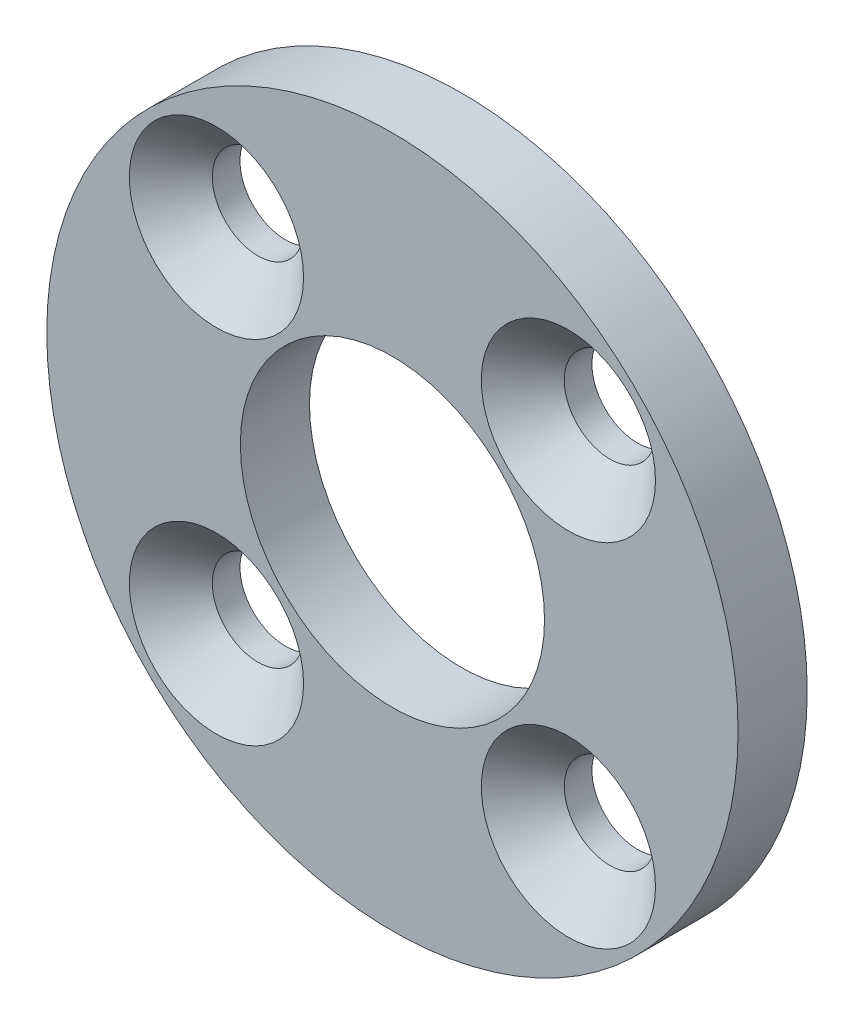
ISO-10303-21;
HEADER;
FILE_DESCRIPTION(('STEP AP214'),'2;1');
FILE_NAME('part.step','',(''),(''),'','','');
FILE_SCHEMA(('AUTOMOTIVE_DESIGN { 1 0 10303 214 1 1 1 1 }'));
ENDSEC;
DATA;
#1=APPLICATION_CONTEXT('core data for automotive mechanical design processes');
#2=APPLICATION_PROTOCOL_DEFINITION('international standard','automotive_design',2000,#1);
#3=PRODUCT_CONTEXT('',#1,'mechanical');
#4=PRODUCT('Part','Part','',(#3));
#5=PRODUCT_RELATED_PRODUCT_CATEGORY('part','',(#4));
#6=PRODUCT_DEFINITION_FORMATION('','',#4);
#7=PRODUCT_DEFINITION_CONTEXT('part definition',#1,'design');
#8=PRODUCT_DEFINITION('design','',#6,#7);
#9=PRODUCT_DEFINITION_SHAPE('','',#8);
#10=(LENGTH_UNIT() NAMED_UNIT(*) SI_UNIT(.MILLI.,.METRE.));
#11=(NAMED_UNIT(*) PLANE_ANGLE_UNIT() SI_UNIT($,.RADIAN.));
#12=(NAMED_UNIT(*) SI_UNIT($,.STERADIAN.) SOLID_ANGLE_UNIT());
#13=UNCERTAINTY_MEASURE_WITH_UNIT(LENGTH_MEASURE(1.E-05),#10,'distance_accuracy_value','');
#14=(GEOMETRIC_REPRESENTATION_CONTEXT(3) GLOBAL_UNCERTAINTY_ASSIGNED_CONTEXT((#13)) GLOBAL_UNIT_ASSIGNED_CONTEXT((#10,
#11,#12)) REPRESENTATION_CONTEXT('',''));
#15=CARTESIAN_POINT('',(0.,0.,0.));
#16=DIRECTION('',(0.,0.,1.));
#17=DIRECTION('',(1.,0.,0.));
#18=AXIS2_PLACEMENT_3D('',#15,#16,#17);
#19=CARTESIAN_POINT('',(0.,0.,5.));
#20=DIRECTION('',(0.,0.,-1.));
#21=DIRECTION('',(-1.,0.,0.));
#22=AXIS2_PLACEMENT_3D('',#19,#20,#21);
#23=CYLINDRICAL_SURFACE('',#22,25.);
#24=CARTESIAN_POINT('',(0.,0.,5.));
#25=DIRECTION('',(0.,0.,1.));
#26=DIRECTION('',(1.,0.,0.));
#27=AXIS2_PLACEMENT_3D('',#24,#25,#26);
#28=CIRCLE('',#27,25.);
#29=CARTESIAN_POINT('',(25.,0.,5.));
#30=VERTEX_POINT('',#29);
#31=EDGE_CURVE('E10',#30,#30,#28,.T.);
#32=ORIENTED_EDGE('',*,*,#31,.F.);
#33=EDGE_LOOP('',(#32));
#34=FACE_BOUND('',#33,.T.);
#35=CARTESIAN_POINT('',(0.,0.,0.));
#36=DIRECTION('',(0.,0.,1.));
#37=DIRECTION('',(1.,0.,0.));
#38=AXIS2_PLACEMENT_3D('',#35,#36,#37);
#39=CIRCLE('',#38,25.);
#40=CARTESIAN_POINT('',(25.,0.,0.));
#41=VERTEX_POINT('',#40);
#42=EDGE_CURVE('E35',#41,#41,#39,.T.);
#43=ORIENTED_EDGE('',*,*,#42,.T.);
#44=EDGE_LOOP('',(#43));
#45=FACE_BOUND('',#44,.T.);
#46=ADVANCED_FACE('F32',(#34,#45),#23,.T.);
#47=CARTESIAN_POINT('',(0.,0.,5.));
#48=DIRECTION('',(0.,0.,1.));
#49=DIRECTION('',(1.,0.,0.));
#50=AXIS2_PLACEMENT_3D('',#47,#48,#49);
#51=PLANE('',#50);
#52=CARTESIAN_POINT('',(12.7279220613579,12.7279220613579,5.));
#53=DIRECTION('',(0.,0.,1.));
#54=DIRECTION('',(1.,0.,0.));
#55=AXIS2_PLACEMENT_3D('',#52,#53,#54);
#56=CIRCLE('',#55,6.3);
#57=CARTESIAN_POINT('',(19.0279220613579,12.7279220613579,5.));
#58=VERTEX_POINT('',#57);
#59=EDGE_CURVE('E82',#58,#58,#56,.T.);
#60=ORIENTED_EDGE('',*,*,#59,.F.);
#61=EDGE_LOOP('',(#60));
#62=FACE_BOUND('',#61,.T.);
#63=CARTESIAN_POINT('',(-12.7279220613579,-12.7279220613579,5.));
#64=DIRECTION('',(0.,0.,1.));
#65=DIRECTION('',(1.,0.,0.));
#66=AXIS2_PLACEMENT_3D('',#63,#64,#65);
#67=CIRCLE('',#66,6.3);
#68=CARTESIAN_POINT('',(-6.42792206135786,-12.7279220613579,5.));
#69=VERTEX_POINT('',#68);
#70=EDGE_CURVE('E73',#69,#69,#67,.T.);
#71=ORIENTED_EDGE('',*,*,#70,.F.);
#72=EDGE_LOOP('',(#71));
#73=FACE_BOUND('',#72,.T.);
#74=CARTESIAN_POINT('',(-12.7279220613579,12.7279220613579,5.));
#75=DIRECTION('',(0.,0.,1.));
#76=DIRECTION('',(1.,0.,0.));
#77=AXIS2_PLACEMENT_3D('',#74,#75,#76);
#78=CIRCLE('',#77,6.3);
#79=CARTESIAN_POINT('',(-6.42792206135786,12.7279220613579,5.));
#80=VERTEX_POINT('',#79);
#81=EDGE_CURVE('E64',#80,#80,#78,.T.);
#82=ORIENTED_EDGE('',*,*,#81,.F.);
#83=EDGE_LOOP('',(#82));
#84=FACE_BOUND('',#83,.T.);
#85=CARTESIAN_POINT('',(12.7279220613579,-12.7279220613579,5.));
#86=DIRECTION('',(0.,0.,1.));
#87=DIRECTION('',(1.,0.,0.));
#88=AXIS2_PLACEMENT_3D('',#85,#86,#87);
#89=CIRCLE('',#88,6.3);
#90=CARTESIAN_POINT('',(19.0279220613579,-12.7279220613579,5.));
#91=VERTEX_POINT('',#90);
#92=EDGE_CURVE('E55',#91,#91,#89,.T.);
#93=ORIENTED_EDGE('',*,*,#92,.F.);
#94=EDGE_LOOP('',(#93));
#95=FACE_BOUND('',#94,.T.);
#96=CARTESIAN_POINT('',(0.,0.,5.));
#97=DIRECTION('',(0.,0.,1.));
#98=DIRECTION('',(1.,0.,0.));
#99=AXIS2_PLACEMENT_3D('',#96,#97,#98);
#100=CIRCLE('',#99,11.);
#101=CARTESIAN_POINT('',(11.,0.,5.));
#102=VERTEX_POINT('',#101);
#103=EDGE_CURVE('E44',#102,#102,#100,.T.);
#104=ORIENTED_EDGE('',*,*,#103,.F.);
#105=EDGE_LOOP('',(#104));
#106=FACE_BOUND('',#105,.T.);
#107=ORIENTED_EDGE('',*,*,#31,.T.);
#108=EDGE_LOOP('',(#107));
#109=FACE_BOUND('',#108,.T.);
#110=ADVANCED_FACE('F88',(#62,#73,#84,#95,#106,#109),#51,.T.);
#111=CARTESIAN_POINT('',(0.,0.,0.));
#112=DIRECTION('',(0.,0.,1.));
#113=DIRECTION('',(1.,0.,0.));
#114=AXIS2_PLACEMENT_3D('',#111,#112,#113);
#115=PLANE('',#114);
#116=CARTESIAN_POINT('',(12.7279220613579,12.7279220613579,0.));
#117=DIRECTION('',(0.,0.,1.));
#118=DIRECTION('',(1.,0.,0.));
#119=AXIS2_PLACEMENT_3D('',#116,#117,#118);
#120=CIRCLE('',#119,3.29999999999999);
#121=CARTESIAN_POINT('',(16.0279220613579,12.7279220613579,0.));
#122=VERTEX_POINT('',#121);
#123=EDGE_CURVE('E76',#122,#122,#120,.T.);
#124=ORIENTED_EDGE('',*,*,#123,.T.);
#125=EDGE_LOOP('',(#124));
#126=FACE_BOUND('',#125,.T.);
#127=CARTESIAN_POINT('',(-12.7279220613579,-12.7279220613579,0.));
#128=DIRECTION('',(0.,0.,1.));
#129=DIRECTION('',(1.,0.,0.));
#130=AXIS2_PLACEMENT_3D('',#127,#128,#129);
#131=CIRCLE('',#130,3.29999999999999);
#132=CARTESIAN_POINT('',(-9.42792206135787,-12.7279220613579,0.));
#133=VERTEX_POINT('',#132);
#134=EDGE_CURVE('E67',#133,#133,#131,.T.);
#135=ORIENTED_EDGE('',*,*,#134,.T.);
#136=EDGE_LOOP('',(#135));
#137=FACE_BOUND('',#136,.T.);
#138=CARTESIAN_POINT('',(-12.7279220613579,12.7279220613579,0.));
#139=DIRECTION('',(0.,0.,1.));
#140=DIRECTION('',(1.,0.,0.));
#141=AXIS2_PLACEMENT_3D('',#138,#139,#140);
#142=CIRCLE('',#141,3.29999999999999);
#143=CARTESIAN_POINT('',(-9.42792206135787,12.7279220613579,0.));
#144=VERTEX_POINT('',#143);
#145=EDGE_CURVE('E58',#144,#144,#142,.T.);
#146=ORIENTED_EDGE('',*,*,#145,.T.);
#147=EDGE_LOOP('',(#146));
#148=FACE_BOUND('',#147,.T.);
#149=CARTESIAN_POINT('',(12.7279220613579,-12.7279220613579,0.));
#150=DIRECTION('',(0.,0.,1.));
#151=DIRECTION('',(1.,0.,0.));
#152=AXIS2_PLACEMENT_3D('',#149,#150,#151);
#153=CIRCLE('',#152,3.29999999999999);
#154=CARTESIAN_POINT('',(16.0279220613579,-12.7279220613579,0.));
#155=VERTEX_POINT('',#154);
#156=EDGE_CURVE('E47',#155,#155,#153,.T.);
#157=ORIENTED_EDGE('',*,*,#156,.T.);
#158=EDGE_LOOP('',(#157));
#159=FACE_BOUND('',#158,.T.);
#160=CARTESIAN_POINT('',(0.,0.,0.));
#161=DIRECTION('',(0.,0.,1.));
#162=DIRECTION('',(1.,0.,0.));
#163=AXIS2_PLACEMENT_3D('',#160,#161,#162);
#164=CIRCLE('',#163,11.);
#165=CARTESIAN_POINT('',(11.,0.,0.));
#166=VERTEX_POINT('',#165);
#167=EDGE_CURVE('E42',#166,#166,#164,.T.);
#168=ORIENTED_EDGE('',*,*,#167,.T.);
#169=EDGE_LOOP('',(#168));
#170=FACE_BOUND('',#169,.T.);
#171=ORIENTED_EDGE('',*,*,#42,.F.);
#172=EDGE_LOOP('',(#171));
#173=FACE_BOUND('',#172,.T.);
#174=ADVANCED_FACE('F91',(#126,#137,#148,#159,#170,#173),#115,.F.);
#175=CARTESIAN_POINT('',(0.,0.,0.));
#176=DIRECTION('',(0.,0.,1.));
#177=DIRECTION('',(1.,0.,0.));
#178=AXIS2_PLACEMENT_3D('',#175,#176,#177);
#179=CYLINDRICAL_SURFACE('',#178,11.);
#180=ORIENTED_EDGE('',*,*,#167,.F.);
#181=EDGE_LOOP('',(#180));
#182=FACE_BOUND('',#181,.T.);
#183=ORIENTED_EDGE('',*,*,#103,.T.);
#184=EDGE_LOOP('',(#183));
#185=FACE_BOUND('',#184,.T.);
#186=ADVANCED_FACE('F101',(#182,#185),#179,.F.);
#187=CARTESIAN_POINT('',(12.7279220613579,-12.7279220613579,5.));
#188=DIRECTION('',(0.,0.,1.));
#189=DIRECTION('',(1.,0.,0.));
#190=AXIS2_PLACEMENT_3D('',#187,#188,#189);
#191=CYLINDRICAL_SURFACE('',#190,3.29999999999999);
#192=ORIENTED_EDGE('',*,*,#156,.F.);
#193=EDGE_LOOP('',(#192));
#194=FACE_BOUND('',#193,.T.);
#195=CARTESIAN_POINT('',(12.7279220613579,-12.7279220613579,2.));
#196=DIRECTION('',(0.,0.,1.));
#197=DIRECTION('',(1.,0.,0.));
#198=AXIS2_PLACEMENT_3D('',#195,#196,#197);
#199=CIRCLE('',#198,3.3);
#200=CARTESIAN_POINT('',(16.0279220613579,-12.7279220613579,2.));
#201=VERTEX_POINT('',#200);
#202=EDGE_CURVE('E52',#201,#201,#199,.T.);
#203=ORIENTED_EDGE('',*,*,#202,.T.);
#204=EDGE_LOOP('',(#203));
#205=FACE_BOUND('',#204,.T.);
#206=ADVANCED_FACE('F103',(#194,#205),#191,.F.);
#207=CARTESIAN_POINT('',(12.7279220613579,-12.7279220613579,5.));
#208=DIRECTION('',(0.,0.,1.));
#209=DIRECTION('',(1.,0.,0.));
#210=AXIS2_PLACEMENT_3D('',#207,#208,#209);
#211=CONICAL_SURFACE('',#210,6.3,0.785398163397448);
#212=ORIENTED_EDGE('',*,*,#202,.F.);
#213=EDGE_LOOP('',(#212));
#214=FACE_BOUND('',#213,.T.);
#215=ORIENTED_EDGE('',*,*,#92,.T.);
#216=EDGE_LOOP('',(#215));
#217=FACE_BOUND('',#216,.T.);
#218=ADVANCED_FACE('F110',(#214,#217),#211,.F.);
#219=CARTESIAN_POINT('',(-12.7279220613579,12.7279220613579,5.));
#220=DIRECTION('',(0.,0.,1.));
#221=DIRECTION('',(1.,0.,0.));
#222=AXIS2_PLACEMENT_3D('',#219,#220,#221);
#223=CYLINDRICAL_SURFACE('',#222,3.29999999999999);
#224=ORIENTED_EDGE('',*,*,#145,.F.);
#225=EDGE_LOOP('',(#224));
#226=FACE_BOUND('',#225,.T.);
#227=CARTESIAN_POINT('',(-12.7279220613579,12.7279220613579,2.));
#228=DIRECTION('',(0.,0.,1.));
#229=DIRECTION('',(1.,0.,0.));
#230=AXIS2_PLACEMENT_3D('',#227,#228,#229);
#231=CIRCLE('',#230,3.3);
#232=CARTESIAN_POINT('',(-9.42792206135786,12.7279220613579,2.));
#233=VERTEX_POINT('',#232);
#234=EDGE_CURVE('E61',#233,#233,#231,.T.);
#235=ORIENTED_EDGE('',*,*,#234,.T.);
#236=EDGE_LOOP('',(#235));
#237=FACE_BOUND('',#236,.T.);
#238=ADVANCED_FACE('F146',(#226,#237),#223,.F.);
#239=CARTESIAN_POINT('',(-12.7279220613579,12.7279220613579,5.));
#240=DIRECTION('',(0.,0.,1.));
#241=DIRECTION('',(1.,0.,0.));
#242=AXIS2_PLACEMENT_3D('',#239,#240,#241);
#243=CONICAL_SURFACE('',#242,6.3,0.785398163397448);
#244=ORIENTED_EDGE('',*,*,#234,.F.);
#245=EDGE_LOOP('',(#244));
#246=FACE_BOUND('',#245,.T.);
#247=ORIENTED_EDGE('',*,*,#81,.T.);
#248=EDGE_LOOP('',(#247));
#249=FACE_BOUND('',#248,.T.);
#250=ADVANCED_FACE('F156',(#246,#249),#243,.F.);
#251=CARTESIAN_POINT('',(-12.7279220613579,-12.7279220613579,5.));
#252=DIRECTION('',(0.,0.,1.));
#253=DIRECTION('',(1.,0.,0.));
#254=AXIS2_PLACEMENT_3D('',#251,#252,#253);
#255=CYLINDRICAL_SURFACE('',#254,3.29999999999999);
#256=ORIENTED_EDGE('',*,*,#134,.F.);
#257=EDGE_LOOP('',(#256));
#258=FACE_BOUND('',#257,.T.);
#259=CARTESIAN_POINT('',(-12.7279220613579,-12.7279220613579,2.));
#260=DIRECTION('',(0.,0.,1.));
#261=DIRECTION('',(1.,0.,0.));
#262=AXIS2_PLACEMENT_3D('',#259,#260,#261);
#263=CIRCLE('',#262,3.3);
#264=CARTESIAN_POINT('',(-9.42792206135786,-12.7279220613579,2.));
#265=VERTEX_POINT('',#264);
#266=EDGE_CURVE('E70',#265,#265,#263,.T.);
#267=ORIENTED_EDGE('',*,*,#266,.T.);
#268=EDGE_LOOP('',(#267));
#269=FACE_BOUND('',#268,.T.);
#270=ADVANCED_FACE('F166',(#258,#269),#255,.F.);
#271=CARTESIAN_POINT('',(-12.7279220613579,-12.7279220613579,5.));
#272=DIRECTION('',(0.,0.,1.));
#273=DIRECTION('',(1.,0.,0.));
#274=AXIS2_PLACEMENT_3D('',#271,#272,#273);
#275=CONICAL_SURFACE('',#274,6.3,0.785398163397448);
#276=ORIENTED_EDGE('',*,*,#266,.F.);
#277=EDGE_LOOP('',(#276));
#278=FACE_BOUND('',#277,.T.);
#279=ORIENTED_EDGE('',*,*,#70,.T.);
#280=EDGE_LOOP('',(#279));
#281=FACE_BOUND('',#280,.T.);
#282=ADVANCED_FACE('F176',(#278,#281),#275,.F.);
#283=CARTESIAN_POINT('',(12.7279220613579,12.7279220613579,5.));
#284=DIRECTION('',(0.,0.,1.));
#285=DIRECTION('',(1.,0.,0.));
#286=AXIS2_PLACEMENT_3D('',#283,#284,#285);
#287=CYLINDRICAL_SURFACE('',#286,3.29999999999999);
#288=ORIENTED_EDGE('',*,*,#123,.F.);
#289=EDGE_LOOP('',(#288));
#290=FACE_BOUND('',#289,.T.);
#291=CARTESIAN_POINT('',(12.7279220613579,12.7279220613579,2.));
#292=DIRECTION('',(0.,0.,1.));
#293=DIRECTION('',(1.,0.,0.));
#294=AXIS2_PLACEMENT_3D('',#291,#292,#293);
#295=CIRCLE('',#294,3.3);
#296=CARTESIAN_POINT('',(16.0279220613579,12.7279220613579,2.));
#297=VERTEX_POINT('',#296);
#298=EDGE_CURVE('E79',#297,#297,#295,.T.);
#299=ORIENTED_EDGE('',*,*,#298,.T.);
#300=EDGE_LOOP('',(#299));
#301=FACE_BOUND('',#300,.T.);
#302=ADVANCED_FACE('F186',(#290,#301),#287,.F.);
#303=CARTESIAN_POINT('',(12.7279220613579,12.7279220613579,5.));
#304=DIRECTION('',(0.,0.,1.));
#305=DIRECTION('',(1.,0.,0.));
#306=AXIS2_PLACEMENT_3D('',#303,#304,#305);
#307=CONICAL_SURFACE('',#306,6.3,0.785398163397448);
#308=ORIENTED_EDGE('',*,*,#298,.F.);
#309=EDGE_LOOP('',(#308));
#310=FACE_BOUND('',#309,.T.);
#311=ORIENTED_EDGE('',*,*,#59,.T.);
#312=EDGE_LOOP('',(#311));
#313=FACE_BOUND('',#312,.T.);
#314=ADVANCED_FACE('F86',(#310,#313),#307,.F.);
#315=CLOSED_SHELL('',(#46,#110,#174,#186,#206,#218,#238,#250,#270,#282,#302,#314));
#316=MANIFOLD_SOLID_BREP('B2',#315);
#317=ADVANCED_BREP_SHAPE_REPRESENTATION('',(#18,#316),#14);
#318=SHAPE_DEFINITION_REPRESENTATION(#9,#317);
ENDSEC;
END-ISO-10303-21;
